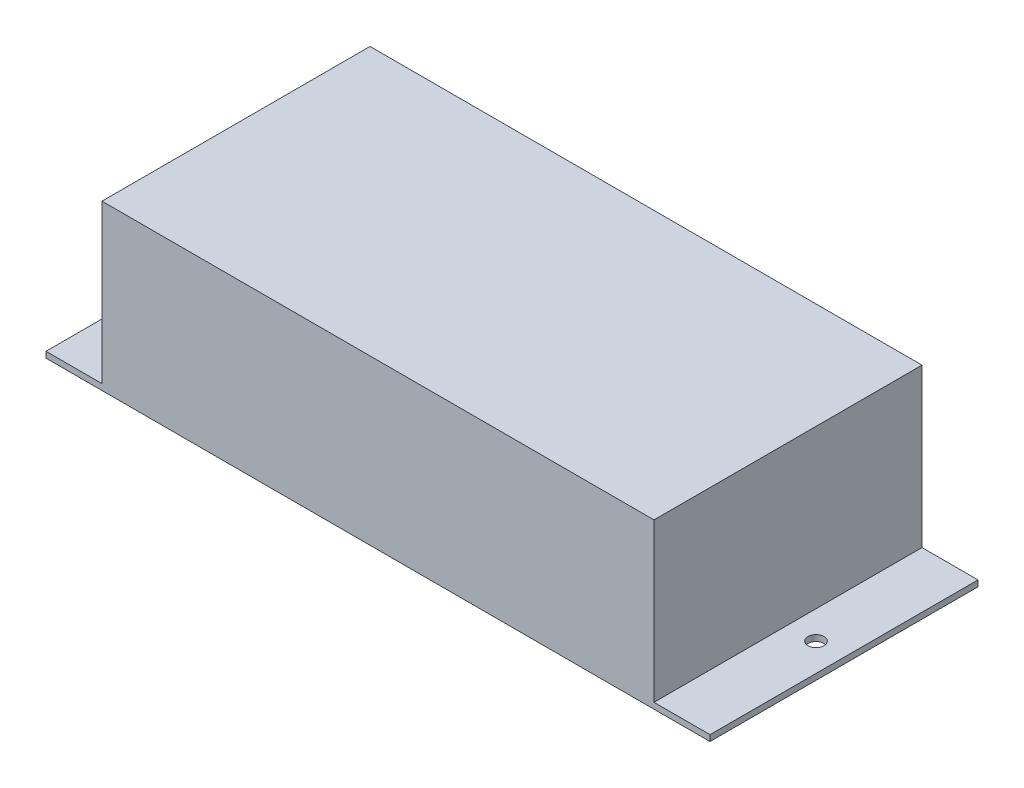
ISO-10303-21;
HEADER;
FILE_DESCRIPTION(('STEP AP214'),'2;1');
FILE_NAME('part.step','',(''),(''),'','','');
FILE_SCHEMA(('AUTOMOTIVE_DESIGN { 1 0 10303 214 1 1 1 1 }'));
ENDSEC;
DATA;
#1=APPLICATION_CONTEXT('core data for automotive mechanical design processes');
#2=APPLICATION_PROTOCOL_DEFINITION('international standard','automotive_design',2000,#1);
#3=PRODUCT_CONTEXT('',#1,'mechanical');
#4=PRODUCT('Part','Part','',(#3));
#5=PRODUCT_RELATED_PRODUCT_CATEGORY('part','',(#4));
#6=PRODUCT_DEFINITION_FORMATION('','',#4);
#7=PRODUCT_DEFINITION_CONTEXT('part definition',#1,'design');
#8=PRODUCT_DEFINITION('design','',#6,#7);
#9=PRODUCT_DEFINITION_SHAPE('','',#8);
#10=(LENGTH_UNIT() NAMED_UNIT(*) SI_UNIT(.MILLI.,.METRE.));
#11=(NAMED_UNIT(*) PLANE_ANGLE_UNIT() SI_UNIT($,.RADIAN.));
#12=(NAMED_UNIT(*) SI_UNIT($,.STERADIAN.) SOLID_ANGLE_UNIT());
#13=UNCERTAINTY_MEASURE_WITH_UNIT(LENGTH_MEASURE(1.E-05),#10,'distance_accuracy_value','');
#14=(GEOMETRIC_REPRESENTATION_CONTEXT(3) GLOBAL_UNCERTAINTY_ASSIGNED_CONTEXT((#13)) GLOBAL_UNIT_ASSIGNED_CONTEXT((#10,
#11,#12)) REPRESENTATION_CONTEXT('',''));
#15=CARTESIAN_POINT('',(0.,0.,0.));
#16=DIRECTION('',(0.,0.,1.));
#17=DIRECTION('',(1.,0.,0.));
#18=AXIS2_PLACEMENT_3D('',#15,#16,#17);
#19=CARTESIAN_POINT('',(83.,1.49999999999999,67.));
#20=DIRECTION('',(0.,-1.,0.));
#21=DIRECTION('',(1.,0.,0.));
#22=AXIS2_PLACEMENT_3D('',#19,#20,#21);
#23=PLANE('',#22);
#24=DIRECTION('',(-1.,0.,0.));
#25=VECTOR('',#24,1.);
#26=CARTESIAN_POINT('',(83.,1.49999999999999,0.));
#27=LINE('',#26,#25);
#28=CARTESIAN_POINT('',(83.,1.49999999999999,0.));
#29=VERTEX_POINT('',#28);
#30=CARTESIAN_POINT('',(69.,1.49999999999999,0.));
#31=VERTEX_POINT('',#30);
#32=EDGE_CURVE('E142',#29,#31,#27,.T.);
#33=ORIENTED_EDGE('',*,*,#32,.T.);
#34=DIRECTION('',(0.,0.,-1.));
#35=VECTOR('',#34,1.);
#36=CARTESIAN_POINT('',(69.,1.49999999999999,67.));
#37=LINE('',#36,#35);
#38=CARTESIAN_POINT('',(69.,1.49999999999999,67.));
#39=VERTEX_POINT('',#38);
#40=EDGE_CURVE('E153',#39,#31,#37,.T.);
#41=ORIENTED_EDGE('',*,*,#40,.F.);
#42=DIRECTION('',(-1.,0.,0.));
#43=VECTOR('',#42,1.);
#44=CARTESIAN_POINT('',(83.,1.49999999999999,67.));
#45=LINE('',#44,#43);
#46=CARTESIAN_POINT('',(83.,1.49999999999999,67.));
#47=VERTEX_POINT('',#46);
#48=EDGE_CURVE('E176',#47,#39,#45,.T.);
#49=ORIENTED_EDGE('',*,*,#48,.F.);
#50=DIRECTION('',(0.,0.,-1.));
#51=VECTOR('',#50,1.);
#52=CARTESIAN_POINT('',(83.,1.49999999999999,67.));
#53=LINE('',#52,#51);
#54=EDGE_CURVE('E156',#47,#29,#53,.T.);
#55=ORIENTED_EDGE('',*,*,#54,.T.);
#56=EDGE_LOOP('',(#33,#41,#49,#55));
#57=FACE_BOUND('',#56,.T.);
#58=CARTESIAN_POINT('',(76.,1.50000000000002,33.5));
#59=DIRECTION('',(0.,1.,0.));
#60=DIRECTION('',(0.,0.,1.));
#61=AXIS2_PLACEMENT_3D('',#58,#59,#60);
#62=CIRCLE('',#61,2.);
#63=CARTESIAN_POINT('',(76.,1.50000000000002,35.5));
#64=VERTEX_POINT('',#63);
#65=EDGE_CURVE('E184',#64,#64,#62,.T.);
#66=ORIENTED_EDGE('',*,*,#65,.F.);
#67=EDGE_LOOP('',(#66));
#68=FACE_BOUND('',#67,.T.);
#69=ADVANCED_FACE('F37',(#57,#68),#23,.F.);
#70=CARTESIAN_POINT('',(-83.,0.,67.));
#71=DIRECTION('',(1.,0.,0.));
#72=DIRECTION('',(0.,1.,0.));
#73=AXIS2_PLACEMENT_3D('',#70,#71,#72);
#74=PLANE('',#73);
#75=DIRECTION('',(0.,-1.,0.));
#76=VECTOR('',#75,1.);
#77=CARTESIAN_POINT('',(-83.,0.,0.));
#78=LINE('',#77,#76);
#79=CARTESIAN_POINT('',(-83.,1.49999999999999,0.));
#80=VERTEX_POINT('',#79);
#81=CARTESIAN_POINT('',(-83.,0.,0.));
#82=VERTEX_POINT('',#81);
#83=EDGE_CURVE('E134',#80,#82,#78,.T.);
#84=ORIENTED_EDGE('',*,*,#83,.T.);
#85=DIRECTION('',(0.,0.,-1.));
#86=VECTOR('',#85,1.);
#87=CARTESIAN_POINT('',(-83.,0.,67.));
#88=LINE('',#87,#86);
#89=CARTESIAN_POINT('',(-83.,0.,67.));
#90=VERTEX_POINT('',#89);
#91=EDGE_CURVE('E11',#90,#82,#88,.T.);
#92=ORIENTED_EDGE('',*,*,#91,.F.);
#93=DIRECTION('',(0.,-1.,0.));
#94=VECTOR('',#93,1.);
#95=CARTESIAN_POINT('',(-83.,0.,67.));
#96=LINE('',#95,#94);
#97=CARTESIAN_POINT('',(-83.,1.49999999999999,67.));
#98=VERTEX_POINT('',#97);
#99=EDGE_CURVE('E149',#98,#90,#96,.T.);
#100=ORIENTED_EDGE('',*,*,#99,.F.);
#101=DIRECTION('',(0.,0.,-1.));
#102=VECTOR('',#101,1.);
#103=CARTESIAN_POINT('',(-83.,1.49999999999999,67.));
#104=LINE('',#103,#102);
#105=EDGE_CURVE('E130',#98,#80,#104,.T.);
#106=ORIENTED_EDGE('',*,*,#105,.T.);
#107=EDGE_LOOP('',(#84,#92,#100,#106));
#108=FACE_BOUND('',#107,.T.);
#109=ADVANCED_FACE('F39',(#108),#74,.F.);
#110=CARTESIAN_POINT('',(83.,0.,67.));
#111=DIRECTION('',(0.,1.,0.));
#112=DIRECTION('',(0.,0.,1.));
#113=AXIS2_PLACEMENT_3D('',#110,#111,#112);
#114=PLANE('',#113);
#115=CARTESIAN_POINT('',(-76.,0.,33.5));
#116=DIRECTION('',(0.,1.,0.));
#117=DIRECTION('',(0.,0.,1.));
#118=AXIS2_PLACEMENT_3D('',#115,#116,#117);
#119=CIRCLE('',#118,2.);
#120=CARTESIAN_POINT('',(-76.,0.,35.5));
#121=VERTEX_POINT('',#120);
#122=EDGE_CURVE('E187',#121,#121,#119,.T.);
#123=ORIENTED_EDGE('',*,*,#122,.T.);
#124=EDGE_LOOP('',(#123));
#125=FACE_BOUND('',#124,.T.);
#126=CARTESIAN_POINT('',(76.,0.,33.5));
#127=DIRECTION('',(0.,1.,0.));
#128=DIRECTION('',(0.,0.,1.));
#129=AXIS2_PLACEMENT_3D('',#126,#127,#128);
#130=CIRCLE('',#129,2.);
#131=CARTESIAN_POINT('',(76.,0.,35.5));
#132=VERTEX_POINT('',#131);
#133=EDGE_CURVE('E138',#132,#132,#130,.T.);
#134=ORIENTED_EDGE('',*,*,#133,.T.);
#135=EDGE_LOOP('',(#134));
#136=FACE_BOUND('',#135,.T.);
#137=DIRECTION('',(1.,0.,0.));
#138=VECTOR('',#137,1.);
#139=CARTESIAN_POINT('',(83.,0.,0.));
#140=LINE('',#139,#138);
#141=CARTESIAN_POINT('',(83.,0.,0.));
#142=VERTEX_POINT('',#141);
#143=EDGE_CURVE('E137',#82,#142,#140,.T.);
#144=ORIENTED_EDGE('',*,*,#143,.T.);
#145=DIRECTION('',(0.,0.,-1.));
#146=VECTOR('',#145,1.);
#147=CARTESIAN_POINT('',(83.,0.,67.));
#148=LINE('',#147,#146);
#149=CARTESIAN_POINT('',(83.,0.,67.));
#150=VERTEX_POINT('',#149);
#151=EDGE_CURVE('E46',#150,#142,#148,.T.);
#152=ORIENTED_EDGE('',*,*,#151,.F.);
#153=DIRECTION('',(1.,0.,0.));
#154=VECTOR('',#153,1.);
#155=CARTESIAN_POINT('',(83.,0.,67.));
#156=LINE('',#155,#154);
#157=EDGE_CURVE('E97',#90,#150,#156,.T.);
#158=ORIENTED_EDGE('',*,*,#157,.F.);
#159=ORIENTED_EDGE('',*,*,#91,.T.);
#160=EDGE_LOOP('',(#144,#152,#158,#159));
#161=FACE_BOUND('',#160,.T.);
#162=ADVANCED_FACE('F211',(#125,#136,#161),#114,.F.);
#163=CARTESIAN_POINT('',(83.,0.,67.));
#164=DIRECTION('',(-1.,0.,0.));
#165=DIRECTION('',(0.,-1.,0.));
#166=AXIS2_PLACEMENT_3D('',#163,#164,#165);
#167=PLANE('',#166);
#168=DIRECTION('',(0.,1.,0.));
#169=VECTOR('',#168,1.);
#170=CARTESIAN_POINT('',(83.,0.,0.));
#171=LINE('',#170,#169);
#172=EDGE_CURVE('E140',#142,#29,#171,.T.);
#173=ORIENTED_EDGE('',*,*,#172,.T.);
#174=ORIENTED_EDGE('',*,*,#54,.F.);
#175=DIRECTION('',(0.,1.,0.));
#176=VECTOR('',#175,1.);
#177=CARTESIAN_POINT('',(83.,0.,67.));
#178=LINE('',#177,#176);
#179=EDGE_CURVE('E164',#150,#47,#178,.T.);
#180=ORIENTED_EDGE('',*,*,#179,.F.);
#181=ORIENTED_EDGE('',*,*,#151,.T.);
#182=EDGE_LOOP('',(#173,#174,#180,#181));
#183=FACE_BOUND('',#182,.T.);
#184=ADVANCED_FACE('F162',(#183),#167,.F.);
#185=CARTESIAN_POINT('',(69.,1.49999999999999,67.));
#186=DIRECTION('',(-1.,0.,0.));
#187=DIRECTION('',(0.,-1.,0.));
#188=AXIS2_PLACEMENT_3D('',#185,#186,#187);
#189=PLANE('',#188);
#190=DIRECTION('',(0.,1.,0.));
#191=VECTOR('',#190,1.);
#192=CARTESIAN_POINT('',(69.,1.49999999999999,0.));
#193=LINE('',#192,#191);
#194=CARTESIAN_POINT('',(69.,41.,0.));
#195=VERTEX_POINT('',#194);
#196=EDGE_CURVE('E144',#31,#195,#193,.T.);
#197=ORIENTED_EDGE('',*,*,#196,.T.);
#198=DIRECTION('',(0.,0.,-1.));
#199=VECTOR('',#198,1.);
#200=CARTESIAN_POINT('',(69.,41.,67.));
#201=LINE('',#200,#199);
#202=CARTESIAN_POINT('',(69.,41.,67.));
#203=VERTEX_POINT('',#202);
#204=EDGE_CURVE('E125',#203,#195,#201,.T.);
#205=ORIENTED_EDGE('',*,*,#204,.F.);
#206=DIRECTION('',(0.,1.,0.));
#207=VECTOR('',#206,1.);
#208=CARTESIAN_POINT('',(69.,1.49999999999999,67.));
#209=LINE('',#208,#207);
#210=EDGE_CURVE('E116',#39,#203,#209,.T.);
#211=ORIENTED_EDGE('',*,*,#210,.F.);
#212=ORIENTED_EDGE('',*,*,#40,.T.);
#213=EDGE_LOOP('',(#197,#205,#211,#212));
#214=FACE_BOUND('',#213,.T.);
#215=ADVANCED_FACE('F175',(#214),#189,.F.);
#216=CARTESIAN_POINT('',(-69.,41.,67.));
#217=DIRECTION('',(0.,-1.,0.));
#218=DIRECTION('',(0.,0.,-1.));
#219=AXIS2_PLACEMENT_3D('',#216,#217,#218);
#220=PLANE('',#219);
#221=DIRECTION('',(-1.,0.,0.));
#222=VECTOR('',#221,1.);
#223=CARTESIAN_POINT('',(-69.,41.,0.));
#224=LINE('',#223,#222);
#225=CARTESIAN_POINT('',(-69.,41.,0.));
#226=VERTEX_POINT('',#225);
#227=EDGE_CURVE('E124',#195,#226,#224,.T.);
#228=ORIENTED_EDGE('',*,*,#227,.T.);
#229=DIRECTION('',(0.,0.,-1.));
#230=VECTOR('',#229,1.);
#231=CARTESIAN_POINT('',(-69.,41.,67.));
#232=LINE('',#231,#230);
#233=CARTESIAN_POINT('',(-69.,41.,67.));
#234=VERTEX_POINT('',#233);
#235=EDGE_CURVE('E121',#234,#226,#232,.T.);
#236=ORIENTED_EDGE('',*,*,#235,.F.);
#237=DIRECTION('',(-1.,0.,0.));
#238=VECTOR('',#237,1.);
#239=CARTESIAN_POINT('',(-69.,41.,67.));
#240=LINE('',#239,#238);
#241=EDGE_CURVE('E110',#203,#234,#240,.T.);
#242=ORIENTED_EDGE('',*,*,#241,.F.);
#243=ORIENTED_EDGE('',*,*,#204,.T.);
#244=EDGE_LOOP('',(#228,#236,#242,#243));
#245=FACE_BOUND('',#244,.T.);
#246=ADVANCED_FACE('F122',(#245),#220,.F.);
#247=CARTESIAN_POINT('',(-69.,1.49999999999999,67.));
#248=DIRECTION('',(1.,0.,0.));
#249=DIRECTION('',(0.,1.,0.));
#250=AXIS2_PLACEMENT_3D('',#247,#248,#249);
#251=PLANE('',#250);
#252=DIRECTION('',(0.,-1.,0.));
#253=VECTOR('',#252,1.);
#254=CARTESIAN_POINT('',(-69.,1.49999999999999,0.));
#255=LINE('',#254,#253);
#256=CARTESIAN_POINT('',(-69.,1.49999999999999,0.));
#257=VERTEX_POINT('',#256);
#258=EDGE_CURVE('E83',#226,#257,#255,.T.);
#259=ORIENTED_EDGE('',*,*,#258,.T.);
#260=DIRECTION('',(0.,0.,-1.));
#261=VECTOR('',#260,1.);
#262=CARTESIAN_POINT('',(-69.,1.49999999999999,67.));
#263=LINE('',#262,#261);
#264=CARTESIAN_POINT('',(-69.,1.49999999999999,67.));
#265=VERTEX_POINT('',#264);
#266=EDGE_CURVE('E126',#265,#257,#263,.T.);
#267=ORIENTED_EDGE('',*,*,#266,.F.);
#268=DIRECTION('',(0.,-1.,0.));
#269=VECTOR('',#268,1.);
#270=CARTESIAN_POINT('',(-69.,1.49999999999999,67.));
#271=LINE('',#270,#269);
#272=EDGE_CURVE('E114',#234,#265,#271,.T.);
#273=ORIENTED_EDGE('',*,*,#272,.F.);
#274=ORIENTED_EDGE('',*,*,#235,.T.);
#275=EDGE_LOOP('',(#259,#267,#273,#274));
#276=FACE_BOUND('',#275,.T.);
#277=ADVANCED_FACE('F128',(#276),#251,.F.);
#278=CARTESIAN_POINT('',(-83.,1.49999999999999,67.));
#279=DIRECTION('',(0.,-1.,0.));
#280=DIRECTION('',(1.,0.,0.));
#281=AXIS2_PLACEMENT_3D('',#278,#279,#280);
#282=PLANE('',#281);
#283=CARTESIAN_POINT('',(-76.,1.49999999999999,33.5));
#284=DIRECTION('',(0.,1.,0.));
#285=DIRECTION('',(0.,0.,1.));
#286=AXIS2_PLACEMENT_3D('',#283,#284,#285);
#287=CIRCLE('',#286,2.);
#288=CARTESIAN_POINT('',(-76.,1.49999999999999,35.5));
#289=VERTEX_POINT('',#288);
#290=EDGE_CURVE('E190',#289,#289,#287,.T.);
#291=ORIENTED_EDGE('',*,*,#290,.F.);
#292=EDGE_LOOP('',(#291));
#293=FACE_BOUND('',#292,.T.);
#294=DIRECTION('',(-1.,0.,0.));
#295=VECTOR('',#294,1.);
#296=CARTESIAN_POINT('',(-83.,1.49999999999999,0.));
#297=LINE('',#296,#295);
#298=EDGE_CURVE('E89',#257,#80,#297,.T.);
#299=ORIENTED_EDGE('',*,*,#298,.T.);
#300=ORIENTED_EDGE('',*,*,#105,.F.);
#301=DIRECTION('',(-1.,0.,0.));
#302=VECTOR('',#301,1.);
#303=CARTESIAN_POINT('',(-83.,1.49999999999999,67.));
#304=LINE('',#303,#302);
#305=EDGE_CURVE('E54',#265,#98,#304,.T.);
#306=ORIENTED_EDGE('',*,*,#305,.F.);
#307=ORIENTED_EDGE('',*,*,#266,.T.);
#308=EDGE_LOOP('',(#299,#300,#306,#307));
#309=FACE_BOUND('',#308,.T.);
#310=ADVANCED_FACE('F196',(#293,#309),#282,.F.);
#311=CARTESIAN_POINT('',(0.,0.,67.));
#312=DIRECTION('',(0.,0.,-1.));
#313=DIRECTION('',(-1.,0.,0.));
#314=AXIS2_PLACEMENT_3D('',#311,#312,#313);
#315=PLANE('',#314);
#316=ORIENTED_EDGE('',*,*,#99,.T.);
#317=ORIENTED_EDGE('',*,*,#157,.T.);
#318=ORIENTED_EDGE('',*,*,#179,.T.);
#319=ORIENTED_EDGE('',*,*,#48,.T.);
#320=ORIENTED_EDGE('',*,*,#210,.T.);
#321=ORIENTED_EDGE('',*,*,#241,.T.);
#322=ORIENTED_EDGE('',*,*,#272,.T.);
#323=ORIENTED_EDGE('',*,*,#305,.T.);
#324=EDGE_LOOP('',(#316,#317,#318,#319,#320,#321,#322,#323));
#325=FACE_BOUND('',#324,.T.);
#326=ADVANCED_FACE('F112',(#325),#315,.F.);
#327=CARTESIAN_POINT('',(0.,0.,0.));
#328=DIRECTION('',(0.,0.,-1.));
#329=DIRECTION('',(-1.,0.,0.));
#330=AXIS2_PLACEMENT_3D('',#327,#328,#329);
#331=PLANE('',#330);
#332=ORIENTED_EDGE('',*,*,#83,.F.);
#333=ORIENTED_EDGE('',*,*,#298,.F.);
#334=ORIENTED_EDGE('',*,*,#258,.F.);
#335=ORIENTED_EDGE('',*,*,#227,.F.);
#336=ORIENTED_EDGE('',*,*,#196,.F.);
#337=ORIENTED_EDGE('',*,*,#32,.F.);
#338=ORIENTED_EDGE('',*,*,#172,.F.);
#339=ORIENTED_EDGE('',*,*,#143,.F.);
#340=EDGE_LOOP('',(#332,#333,#334,#335,#336,#337,#338,#339));
#341=FACE_BOUND('',#340,.T.);
#342=ADVANCED_FACE('F168',(#341),#331,.T.);
#343=CARTESIAN_POINT('',(76.,1.50000000000002,33.5));
#344=DIRECTION('',(0.,1.,0.));
#345=DIRECTION('',(0.,0.,1.));
#346=AXIS2_PLACEMENT_3D('',#343,#344,#345);
#347=CYLINDRICAL_SURFACE('',#346,2.);
#348=ORIENTED_EDGE('',*,*,#133,.F.);
#349=EDGE_LOOP('',(#348));
#350=FACE_BOUND('',#349,.T.);
#351=ORIENTED_EDGE('',*,*,#65,.T.);
#352=EDGE_LOOP('',(#351));
#353=FACE_BOUND('',#352,.T.);
#354=ADVANCED_FACE('F227',(#350,#353),#347,.F.);
#355=CARTESIAN_POINT('',(-76.,1.49999999999999,33.5));
#356=DIRECTION('',(0.,1.,0.));
#357=DIRECTION('',(0.,0.,1.));
#358=AXIS2_PLACEMENT_3D('',#355,#356,#357);
#359=CYLINDRICAL_SURFACE('',#358,2.);
#360=ORIENTED_EDGE('',*,*,#122,.F.);
#361=EDGE_LOOP('',(#360));
#362=FACE_BOUND('',#361,.T.);
#363=ORIENTED_EDGE('',*,*,#290,.T.);
#364=EDGE_LOOP('',(#363));
#365=FACE_BOUND('',#364,.T.);
#366=ADVANCED_FACE('F194',(#362,#365),#359,.F.);
#367=CLOSED_SHELL('',(#69,#109,#162,#184,#215,#246,#277,#310,#326,#342,#354,#366));
#368=MANIFOLD_SOLID_BREP('B2',#367);
#369=ADVANCED_BREP_SHAPE_REPRESENTATION('',(#18,#368),#14);
#370=SHAPE_DEFINITION_REPRESENTATION(#9,#369);
ENDSEC;
END-ISO-10303-21;
